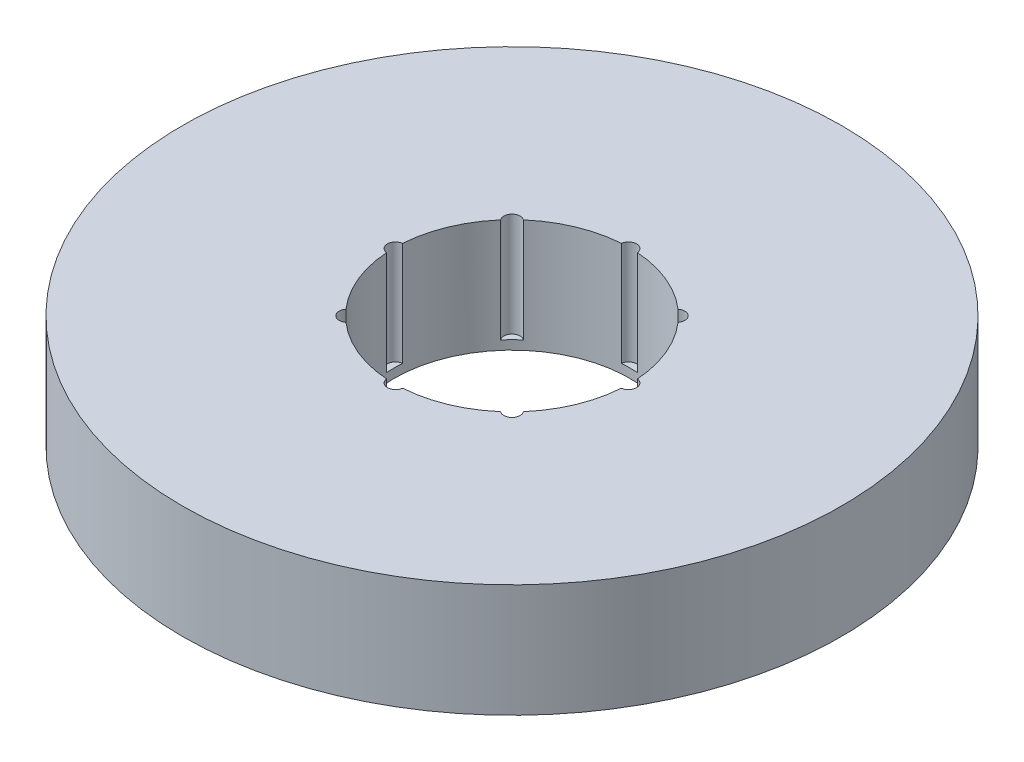
ISO-10303-21;
HEADER;
FILE_DESCRIPTION(('STEP AP214'),'2;1');
FILE_NAME('part.step','',(''),(''),'','','');
FILE_SCHEMA(('AUTOMOTIVE_DESIGN { 1 0 10303 214 1 1 1 1 }'));
ENDSEC;
DATA;
#1=APPLICATION_CONTEXT('core data for automotive mechanical design processes');
#2=APPLICATION_PROTOCOL_DEFINITION('international standard','automotive_design',2000,#1);
#3=PRODUCT_CONTEXT('',#1,'mechanical');
#4=PRODUCT('Part','Part','',(#3));
#5=PRODUCT_RELATED_PRODUCT_CATEGORY('part','',(#4));
#6=PRODUCT_DEFINITION_FORMATION('','',#4);
#7=PRODUCT_DEFINITION_CONTEXT('part definition',#1,'design');
#8=PRODUCT_DEFINITION('design','',#6,#7);
#9=PRODUCT_DEFINITION_SHAPE('','',#8);
#10=(LENGTH_UNIT() NAMED_UNIT(*) SI_UNIT(.MILLI.,.METRE.));
#11=(NAMED_UNIT(*) PLANE_ANGLE_UNIT() SI_UNIT($,.RADIAN.));
#12=(NAMED_UNIT(*) SI_UNIT($,.STERADIAN.) SOLID_ANGLE_UNIT());
#13=UNCERTAINTY_MEASURE_WITH_UNIT(LENGTH_MEASURE(1.E-05),#10,'distance_accuracy_value','');
#14=(GEOMETRIC_REPRESENTATION_CONTEXT(3) GLOBAL_UNCERTAINTY_ASSIGNED_CONTEXT((#13)) GLOBAL_UNIT_ASSIGNED_CONTEXT((#10,
#11,#12)) REPRESENTATION_CONTEXT('',''));
#15=CARTESIAN_POINT('',(0.,0.,0.));
#16=DIRECTION('',(0.,0.,1.));
#17=DIRECTION('',(1.,0.,0.));
#18=AXIS2_PLACEMENT_3D('',#15,#16,#17);
#19=CARTESIAN_POINT('',(0.,24.,0.));
#20=DIRECTION('',(0.,-1.,0.));
#21=DIRECTION('',(0.,0.,-1.));
#22=AXIS2_PLACEMENT_3D('',#19,#20,#21);
#23=CYLINDRICAL_SURFACE('',#22,70.);
#24=CARTESIAN_POINT('',(0.,24.,0.));
#25=DIRECTION('',(0.,1.,0.));
#26=DIRECTION('',(0.,0.,1.));
#27=AXIS2_PLACEMENT_3D('',#24,#25,#26);
#28=CIRCLE('',#27,70.);
#29=CARTESIAN_POINT('',(0.,24.,70.));
#30=VERTEX_POINT('',#29);
#31=EDGE_CURVE('E183',#30,#30,#28,.T.);
#32=ORIENTED_EDGE('',*,*,#31,.F.);
#33=EDGE_LOOP('',(#32));
#34=FACE_BOUND('',#33,.T.);
#35=CARTESIAN_POINT('',(0.,0.,0.));
#36=DIRECTION('',(0.,1.,0.));
#37=DIRECTION('',(0.,0.,1.));
#38=AXIS2_PLACEMENT_3D('',#35,#36,#37);
#39=CIRCLE('',#38,70.);
#40=CARTESIAN_POINT('',(0.,0.,70.));
#41=VERTEX_POINT('',#40);
#42=EDGE_CURVE('E182',#41,#41,#39,.T.);
#43=ORIENTED_EDGE('',*,*,#42,.T.);
#44=EDGE_LOOP('',(#43));
#45=FACE_BOUND('',#44,.T.);
#46=ADVANCED_FACE('F39',(#34,#45),#23,.T.);
#47=CARTESIAN_POINT('',(0.,24.,0.));
#48=DIRECTION('',(0.,1.,0.));
#49=DIRECTION('',(0.,0.,1.));
#50=AXIS2_PLACEMENT_3D('',#47,#48,#49);
#51=PLANE('',#50);
#52=CARTESIAN_POINT('',(0.,24.,24.7356284627399));
#53=DIRECTION('',(0.,1.,0.));
#54=DIRECTION('',(1.,0.,0.));
#55=AXIS2_PLACEMENT_3D('',#52,#53,#54);
#56=CIRCLE('',#55,1.72206010410518);
#57=CARTESIAN_POINT('',(-1.70971361540143,24.,24.9414690696701));
#58=VERTEX_POINT('',#57);
#59=CARTESIAN_POINT('',(1.70971361540161,24.,24.9414690696701));
#60=VERTEX_POINT('',#59);
#61=EDGE_CURVE('E256',#58,#60,#56,.T.);
#62=ORIENTED_EDGE('',*,*,#61,.F.);
#63=CARTESIAN_POINT('',(0.,24.,0.));
#64=DIRECTION('',(0.,1.,0.));
#65=DIRECTION('',(0.,0.,1.));
#66=AXIS2_PLACEMENT_3D('',#63,#64,#65);
#67=CIRCLE('',#66,25.);
#68=CARTESIAN_POINT('',(-16.4273318205809,24.,18.8452320032557));
#69=VERTEX_POINT('',#68);
#70=EDGE_CURVE('E175',#69,#58,#67,.T.);
#71=ORIENTED_EDGE('',*,*,#70,.F.);
#72=CARTESIAN_POINT('',(-17.4907306229143,24.,17.4907306229144));
#73=DIRECTION('',(0.,1.,0.));
#74=DIRECTION('',(0.707106781186549,0.,0.707106781186546));
#75=AXIS2_PLACEMENT_3D('',#72,#73,#74);
#76=CIRCLE('',#75,1.72206010410518);
#77=CARTESIAN_POINT('',(-18.8452320032556,24.,16.4273318205809));
#78=VERTEX_POINT('',#77);
#79=EDGE_CURVE('E152',#78,#69,#76,.T.);
#80=ORIENTED_EDGE('',*,*,#79,.F.);
#81=CARTESIAN_POINT('',(-24.9414690696701,24.,1.70971361540152));
#82=VERTEX_POINT('',#81);
#83=EDGE_CURVE('E168',#82,#78,#67,.T.);
#84=ORIENTED_EDGE('',*,*,#83,.F.);
#85=CARTESIAN_POINT('',(-24.7356284627399,24.,0.));
#86=DIRECTION('',(0.,1.,0.));
#87=DIRECTION('',(0.,0.,1.));
#88=AXIS2_PLACEMENT_3D('',#85,#86,#87);
#89=CIRCLE('',#88,1.72206010410518);
#90=CARTESIAN_POINT('',(-24.9414690696701,24.,-1.70971361540152));
#91=VERTEX_POINT('',#90);
#92=EDGE_CURVE('E205',#91,#82,#89,.T.);
#93=ORIENTED_EDGE('',*,*,#92,.F.);
#94=CARTESIAN_POINT('',(-18.8452320032558,24.,-16.4273318205806));
#95=VERTEX_POINT('',#94);
#96=EDGE_CURVE('E181',#95,#91,#67,.T.);
#97=ORIENTED_EDGE('',*,*,#96,.F.);
#98=CARTESIAN_POINT('',(-17.4907306229145,24.,-17.4907306229141));
#99=DIRECTION('',(0.,1.,0.));
#100=DIRECTION('',(-0.707106781186539,0.,0.707106781186556));
#101=AXIS2_PLACEMENT_3D('',#98,#99,#100);
#102=CIRCLE('',#101,1.72206010410518);
#103=CARTESIAN_POINT('',(-16.4273318205811,24.,-18.8452320032554));
#104=VERTEX_POINT('',#103);
#105=EDGE_CURVE('E453',#104,#95,#102,.T.);
#106=ORIENTED_EDGE('',*,*,#105,.F.);
#107=CARTESIAN_POINT('',(-1.70971361540178,24.,-24.9414690696701));
#108=VERTEX_POINT('',#107);
#109=EDGE_CURVE('E189',#108,#104,#67,.T.);
#110=ORIENTED_EDGE('',*,*,#109,.F.);
#111=CARTESIAN_POINT('',(-2.5909195554664E-13,24.,-24.7356284627399));
#112=DIRECTION('',(0.,1.,0.));
#113=DIRECTION('',(-1.,0.,0.));
#114=AXIS2_PLACEMENT_3D('',#111,#112,#113);
#115=CIRCLE('',#114,1.72206010410518);
#116=CARTESIAN_POINT('',(1.70971361540126,24.,-24.9414690696701));
#117=VERTEX_POINT('',#116);
#118=EDGE_CURVE('E462',#117,#108,#115,.T.);
#119=ORIENTED_EDGE('',*,*,#118,.F.);
#120=CARTESIAN_POINT('',(16.4273318205807,24.,-18.8452320032558));
#121=VERTEX_POINT('',#120);
#122=EDGE_CURVE('E197',#121,#117,#67,.T.);
#123=ORIENTED_EDGE('',*,*,#122,.F.);
#124=CARTESIAN_POINT('',(17.4907306229142,24.,-17.4907306229145));
#125=DIRECTION('',(0.,1.,0.));
#126=DIRECTION('',(-0.707106781186554,0.,-0.707106781186541));
#127=AXIS2_PLACEMENT_3D('',#124,#125,#126);
#128=CIRCLE('',#127,1.72206010410518);
#129=CARTESIAN_POINT('',(18.8452320032555,24.,-16.427331820581));
#130=VERTEX_POINT('',#129);
#131=EDGE_CURVE('E470',#130,#121,#128,.T.);
#132=ORIENTED_EDGE('',*,*,#131,.F.);
#133=CARTESIAN_POINT('',(24.9414690696701,24.,-1.70971361540152));
#134=VERTEX_POINT('',#133);
#135=EDGE_CURVE('E489',#134,#130,#67,.T.);
#136=ORIENTED_EDGE('',*,*,#135,.F.);
#137=CARTESIAN_POINT('',(24.7356284627399,24.,0.));
#138=DIRECTION('',(0.,1.,0.));
#139=DIRECTION('',(0.,0.,-1.));
#140=AXIS2_PLACEMENT_3D('',#137,#138,#139);
#141=CIRCLE('',#140,1.72206010410518);
#142=CARTESIAN_POINT('',(24.9414690696701,24.,1.70971361540152));
#143=VERTEX_POINT('',#142);
#144=EDGE_CURVE('E476',#143,#134,#141,.T.);
#145=ORIENTED_EDGE('',*,*,#144,.F.);
#146=CARTESIAN_POINT('',(18.8452320032557,24.,16.4273318205808));
#147=VERTEX_POINT('',#146);
#148=EDGE_CURVE('E491',#147,#143,#67,.T.);
#149=ORIENTED_EDGE('',*,*,#148,.F.);
#150=CARTESIAN_POINT('',(17.4907306229144,24.,17.4907306229142));
#151=DIRECTION('',(0.,1.,0.));
#152=DIRECTION('',(0.707106781186544,0.,-0.707106781186551));
#153=AXIS2_PLACEMENT_3D('',#150,#151,#152);
#154=CIRCLE('',#153,1.72206010410518);
#155=CARTESIAN_POINT('',(16.427331820581,24.,18.8452320032556));
#156=VERTEX_POINT('',#155);
#157=EDGE_CURVE('E475',#156,#147,#154,.T.);
#158=ORIENTED_EDGE('',*,*,#157,.F.);
#159=EDGE_CURVE('E190',#60,#156,#67,.T.);
#160=ORIENTED_EDGE('',*,*,#159,.F.);
#161=EDGE_LOOP('',(#62,#71,#80,#84,#93,#97,#106,#110,#119,#123,#132,#136,#145,#149,#158,#160));
#162=FACE_BOUND('',#161,.T.);
#163=ORIENTED_EDGE('',*,*,#31,.T.);
#164=EDGE_LOOP('',(#163));
#165=FACE_BOUND('',#164,.T.);
#166=ADVANCED_FACE('F170',(#162,#165),#51,.T.);
#167=CARTESIAN_POINT('',(0.,0.,0.));
#168=DIRECTION('',(0.,1.,0.));
#169=DIRECTION('',(0.,0.,1.));
#170=AXIS2_PLACEMENT_3D('',#167,#168,#169);
#171=PLANE('',#170);
#172=CARTESIAN_POINT('',(0.,0.,0.));
#173=DIRECTION('',(0.,1.,0.));
#174=DIRECTION('',(0.,0.,1.));
#175=AXIS2_PLACEMENT_3D('',#172,#173,#174);
#176=CIRCLE('',#175,25.);
#177=CARTESIAN_POINT('',(0.,0.,25.));
#178=VERTEX_POINT('',#177);
#179=EDGE_CURVE('E191',#178,#178,#176,.T.);
#180=ORIENTED_EDGE('',*,*,#179,.T.);
#181=EDGE_LOOP('',(#180));
#182=FACE_BOUND('',#181,.T.);
#183=ORIENTED_EDGE('',*,*,#42,.F.);
#184=EDGE_LOOP('',(#183));
#185=FACE_BOUND('',#184,.T.);
#186=ADVANCED_FACE('F277',(#182,#185),#171,.F.);
#187=CARTESIAN_POINT('',(0.,24.,0.));
#188=DIRECTION('',(0.,-1.,0.));
#189=DIRECTION('',(0.,0.,-1.));
#190=AXIS2_PLACEMENT_3D('',#187,#188,#189);
#191=CYLINDRICAL_SURFACE('',#190,25.);
#192=DIRECTION('',(0.,1.,0.));
#193=VECTOR('',#192,1.);
#194=CARTESIAN_POINT('',(-1.70971361540143,12.9616445948946,24.9414690696701));
#195=LINE('',#194,#193);
#196=CARTESIAN_POINT('',(-1.70971361540143,1.92328918978923,24.9414690696701));
#197=VERTEX_POINT('',#196);
#198=EDGE_CURVE('E11',#197,#58,#195,.T.);
#199=ORIENTED_EDGE('',*,*,#198,.F.);
#200=CARTESIAN_POINT('',(0.,1.92328918978923,0.));
#201=DIRECTION('',(0.,1.,0.));
#202=DIRECTION('',(0.,0.,1.));
#203=AXIS2_PLACEMENT_3D('',#200,#201,#202);
#204=CIRCLE('',#203,25.);
#205=CARTESIAN_POINT('',(1.70971361540161,1.92328918978923,24.9414690696701));
#206=VERTEX_POINT('',#205);
#207=EDGE_CURVE('E251',#197,#206,#204,.T.);
#208=ORIENTED_EDGE('',*,*,#207,.T.);
#209=DIRECTION('',(0.,1.,0.));
#210=VECTOR('',#209,1.);
#211=CARTESIAN_POINT('',(1.70971361540161,12.9616445948946,24.9414690696701));
#212=LINE('',#211,#210);
#213=EDGE_CURVE('E46',#60,#206,#212,.F.);
#214=ORIENTED_EDGE('',*,*,#213,.F.);
#215=ORIENTED_EDGE('',*,*,#159,.T.);
#216=DIRECTION('',(0.,1.,0.));
#217=VECTOR('',#216,1.);
#218=CARTESIAN_POINT('',(16.427331820581,12.9616445948946,18.8452320032556));
#219=LINE('',#218,#217);
#220=CARTESIAN_POINT('',(16.427331820581,1.92328918978923,18.8452320032556));
#221=VERTEX_POINT('',#220);
#222=EDGE_CURVE('E253',#221,#156,#219,.T.);
#223=ORIENTED_EDGE('',*,*,#222,.F.);
#224=CARTESIAN_POINT('',(0.,1.92328918978923,0.));
#225=DIRECTION('',(0.,1.,0.));
#226=DIRECTION('',(0.,0.,1.));
#227=AXIS2_PLACEMENT_3D('',#224,#225,#226);
#228=CIRCLE('',#227,25.);
#229=CARTESIAN_POINT('',(18.8452320032557,1.92328918978923,16.4273318205808));
#230=VERTEX_POINT('',#229);
#231=EDGE_CURVE('E246',#221,#230,#228,.T.);
#232=ORIENTED_EDGE('',*,*,#231,.T.);
#233=DIRECTION('',(0.,1.,0.));
#234=VECTOR('',#233,1.);
#235=CARTESIAN_POINT('',(18.8452320032557,12.9616445948946,16.4273318205808));
#236=LINE('',#235,#234);
#237=EDGE_CURVE('E248',#147,#230,#236,.F.);
#238=ORIENTED_EDGE('',*,*,#237,.F.);
#239=ORIENTED_EDGE('',*,*,#148,.T.);
#240=DIRECTION('',(0.,1.,0.));
#241=VECTOR('',#240,1.);
#242=CARTESIAN_POINT('',(24.9414690696701,12.9616445948946,1.70971361540152));
#243=LINE('',#242,#241);
#244=CARTESIAN_POINT('',(24.9414690696701,1.92328918978923,1.70971361540152));
#245=VERTEX_POINT('',#244);
#246=EDGE_CURVE('E243',#245,#143,#243,.T.);
#247=ORIENTED_EDGE('',*,*,#246,.F.);
#248=CARTESIAN_POINT('',(0.,1.92328918978923,0.));
#249=DIRECTION('',(0.,1.,0.));
#250=DIRECTION('',(0.,0.,1.));
#251=AXIS2_PLACEMENT_3D('',#248,#249,#250);
#252=CIRCLE('',#251,25.);
#253=CARTESIAN_POINT('',(24.9414690696701,1.92328918978923,-1.70971361540152));
#254=VERTEX_POINT('',#253);
#255=EDGE_CURVE('E236',#245,#254,#252,.T.);
#256=ORIENTED_EDGE('',*,*,#255,.T.);
#257=DIRECTION('',(0.,1.,0.));
#258=VECTOR('',#257,1.);
#259=CARTESIAN_POINT('',(24.9414690696701,12.9616445948946,-1.70971361540152));
#260=LINE('',#259,#258);
#261=EDGE_CURVE('E241',#134,#254,#260,.F.);
#262=ORIENTED_EDGE('',*,*,#261,.F.);
#263=ORIENTED_EDGE('',*,*,#135,.T.);
#264=DIRECTION('',(0.,1.,0.));
#265=VECTOR('',#264,1.);
#266=CARTESIAN_POINT('',(18.8452320032555,12.9616445948946,-16.427331820581));
#267=LINE('',#266,#265);
#268=CARTESIAN_POINT('',(18.8452320032555,1.92328918978923,-16.427331820581));
#269=VERTEX_POINT('',#268);
#270=EDGE_CURVE('E237',#269,#130,#267,.T.);
#271=ORIENTED_EDGE('',*,*,#270,.F.);
#272=CARTESIAN_POINT('',(0.,1.92328918978923,0.));
#273=DIRECTION('',(0.,1.,0.));
#274=DIRECTION('',(0.,0.,1.));
#275=AXIS2_PLACEMENT_3D('',#272,#273,#274);
#276=CIRCLE('',#275,25.);
#277=CARTESIAN_POINT('',(16.4273318205807,1.92328918978923,-18.8452320032558));
#278=VERTEX_POINT('',#277);
#279=EDGE_CURVE('E229',#269,#278,#276,.T.);
#280=ORIENTED_EDGE('',*,*,#279,.T.);
#281=DIRECTION('',(0.,1.,0.));
#282=VECTOR('',#281,1.);
#283=CARTESIAN_POINT('',(16.4273318205807,12.9616445948946,-18.8452320032558));
#284=LINE('',#283,#282);
#285=EDGE_CURVE('E232',#121,#278,#284,.F.);
#286=ORIENTED_EDGE('',*,*,#285,.F.);
#287=ORIENTED_EDGE('',*,*,#122,.T.);
#288=DIRECTION('',(0.,1.,0.));
#289=VECTOR('',#288,1.);
#290=CARTESIAN_POINT('',(1.70971361540126,12.9616445948946,-24.9414690696701));
#291=LINE('',#290,#289);
#292=CARTESIAN_POINT('',(1.70971361540126,1.92328918978923,-24.9414690696701));
#293=VERTEX_POINT('',#292);
#294=EDGE_CURVE('E227',#293,#117,#291,.T.);
#295=ORIENTED_EDGE('',*,*,#294,.F.);
#296=CARTESIAN_POINT('',(0.,1.92328918978923,0.));
#297=DIRECTION('',(0.,1.,0.));
#298=DIRECTION('',(0.,0.,1.));
#299=AXIS2_PLACEMENT_3D('',#296,#297,#298);
#300=CIRCLE('',#299,25.);
#301=CARTESIAN_POINT('',(-1.70971361540178,1.92328918978923,-24.9414690696701));
#302=VERTEX_POINT('',#301);
#303=EDGE_CURVE('E225',#293,#302,#300,.T.);
#304=ORIENTED_EDGE('',*,*,#303,.T.);
#305=DIRECTION('',(0.,1.,0.));
#306=VECTOR('',#305,1.);
#307=CARTESIAN_POINT('',(-1.70971361540178,12.9616445948946,-24.9414690696701));
#308=LINE('',#307,#306);
#309=EDGE_CURVE('E223',#108,#302,#308,.F.);
#310=ORIENTED_EDGE('',*,*,#309,.F.);
#311=ORIENTED_EDGE('',*,*,#109,.T.);
#312=DIRECTION('',(0.,1.,0.));
#313=VECTOR('',#312,1.);
#314=CARTESIAN_POINT('',(-16.4273318205811,12.9616445948946,-18.8452320032555));
#315=LINE('',#314,#313);
#316=CARTESIAN_POINT('',(-16.4273318205811,1.92328918978923,-18.8452320032554));
#317=VERTEX_POINT('',#316);
#318=EDGE_CURVE('E219',#317,#104,#315,.T.);
#319=ORIENTED_EDGE('',*,*,#318,.F.);
#320=CARTESIAN_POINT('',(0.,1.92328918978923,0.));
#321=DIRECTION('',(0.,1.,0.));
#322=DIRECTION('',(0.,0.,1.));
#323=AXIS2_PLACEMENT_3D('',#320,#321,#322);
#324=CIRCLE('',#323,25.);
#325=CARTESIAN_POINT('',(-18.8452320032558,1.92328918978923,-16.4273318205806));
#326=VERTEX_POINT('',#325);
#327=EDGE_CURVE('E159',#317,#326,#324,.T.);
#328=ORIENTED_EDGE('',*,*,#327,.T.);
#329=DIRECTION('',(0.,1.,0.));
#330=VECTOR('',#329,1.);
#331=CARTESIAN_POINT('',(-18.8452320032559,12.9616445948946,-16.4273318205807));
#332=LINE('',#331,#330);
#333=EDGE_CURVE('E220',#95,#326,#332,.F.);
#334=ORIENTED_EDGE('',*,*,#333,.F.);
#335=ORIENTED_EDGE('',*,*,#96,.T.);
#336=DIRECTION('',(0.,1.,0.));
#337=VECTOR('',#336,1.);
#338=CARTESIAN_POINT('',(-24.9414690696701,12.9616445948946,-1.70971361540152));
#339=LINE('',#338,#337);
#340=CARTESIAN_POINT('',(-24.9414690696701,1.92328918978923,-1.70971361540152));
#341=VERTEX_POINT('',#340);
#342=EDGE_CURVE('E209',#341,#91,#339,.T.);
#343=ORIENTED_EDGE('',*,*,#342,.F.);
#344=CARTESIAN_POINT('',(0.,1.92328918978923,0.));
#345=DIRECTION('',(0.,1.,0.));
#346=DIRECTION('',(0.,0.,1.));
#347=AXIS2_PLACEMENT_3D('',#344,#345,#346);
#348=CIRCLE('',#347,25.);
#349=CARTESIAN_POINT('',(-24.9414690696701,1.92328918978923,1.70971361540152));
#350=VERTEX_POINT('',#349);
#351=EDGE_CURVE('E206',#341,#350,#348,.T.);
#352=ORIENTED_EDGE('',*,*,#351,.T.);
#353=DIRECTION('',(0.,1.,0.));
#354=VECTOR('',#353,1.);
#355=CARTESIAN_POINT('',(-24.9414690696701,12.9616445948946,1.70971361540152));
#356=LINE('',#355,#354);
#357=EDGE_CURVE('E179',#82,#350,#356,.F.);
#358=ORIENTED_EDGE('',*,*,#357,.F.);
#359=ORIENTED_EDGE('',*,*,#83,.T.);
#360=DIRECTION('',(0.,1.,0.));
#361=VECTOR('',#360,1.);
#362=CARTESIAN_POINT('',(-18.8452320032556,12.9616445948946,16.4273318205809));
#363=LINE('',#362,#361);
#364=CARTESIAN_POINT('',(-18.8452320032556,1.92328918978923,16.4273318205809));
#365=VERTEX_POINT('',#364);
#366=EDGE_CURVE('E147',#365,#78,#363,.T.);
#367=ORIENTED_EDGE('',*,*,#366,.F.);
#368=CARTESIAN_POINT('',(0.,1.92328918978923,0.));
#369=DIRECTION('',(0.,1.,0.));
#370=DIRECTION('',(0.,0.,1.));
#371=AXIS2_PLACEMENT_3D('',#368,#369,#370);
#372=CIRCLE('',#371,25.);
#373=CARTESIAN_POINT('',(-16.4273318205809,1.92328918978923,18.8452320032557));
#374=VERTEX_POINT('',#373);
#375=EDGE_CURVE('E215',#365,#374,#372,.T.);
#376=ORIENTED_EDGE('',*,*,#375,.T.);
#377=DIRECTION('',(0.,1.,0.));
#378=VECTOR('',#377,1.);
#379=CARTESIAN_POINT('',(-16.4273318205809,12.9616445948946,18.8452320032557));
#380=LINE('',#379,#378);
#381=EDGE_CURVE('E161',#69,#374,#380,.F.);
#382=ORIENTED_EDGE('',*,*,#381,.F.);
#383=ORIENTED_EDGE('',*,*,#70,.T.);
#384=EDGE_LOOP('',(#199,#208,#214,#215,#223,#232,#238,#239,#247,#256,#262,#263,#271,#280,#286,
#287,#295,#304,#310,#311,#319,#328,#334,#335,#343,#352,#358,#359,#367,#376,#382,#383));
#385=FACE_BOUND('',#384,.T.);
#386=ORIENTED_EDGE('',*,*,#179,.F.);
#387=EDGE_LOOP('',(#386));
#388=FACE_BOUND('',#387,.T.);
#389=ADVANCED_FACE('F176',(#385,#388),#191,.F.);
#390=CARTESIAN_POINT('',(-24.7356284627399,1.92328918978923,0.));
#391=DIRECTION('',(0.,1.,0.));
#392=DIRECTION('',(0.,0.,1.));
#393=AXIS2_PLACEMENT_3D('',#390,#391,#392);
#394=CYLINDRICAL_SURFACE('',#393,1.72206010410518);
#395=ORIENTED_EDGE('',*,*,#342,.T.);
#396=ORIENTED_EDGE('',*,*,#92,.T.);
#397=ORIENTED_EDGE('',*,*,#357,.T.);
#398=CARTESIAN_POINT('',(-24.7356284627399,1.92328918978923,0.));
#399=DIRECTION('',(0.,1.,0.));
#400=DIRECTION('',(0.,0.,1.));
#401=AXIS2_PLACEMENT_3D('',#398,#399,#400);
#402=CIRCLE('',#401,1.72206010410518);
#403=EDGE_CURVE('E200',#341,#350,#402,.T.);
#404=ORIENTED_EDGE('',*,*,#403,.F.);
#405=EDGE_LOOP('',(#395,#396,#397,#404));
#406=FACE_BOUND('',#405,.T.);
#407=ADVANCED_FACE('F286',(#406),#394,.F.);
#408=CARTESIAN_POINT('',(-24.7356284627399,1.92328918978923,0.));
#409=DIRECTION('',(0.,1.,0.));
#410=DIRECTION('',(0.,0.,1.));
#411=AXIS2_PLACEMENT_3D('',#408,#409,#410);
#412=PLANE('',#411);
#413=ORIENTED_EDGE('',*,*,#403,.T.);
#414=ORIENTED_EDGE('',*,*,#351,.F.);
#415=EDGE_LOOP('',(#413,#414));
#416=FACE_BOUND('',#415,.T.);
#417=ADVANCED_FACE('F289',(#416),#412,.T.);
#418=CARTESIAN_POINT('',(-17.4907306229143,1.92328918978923,17.4907306229144));
#419=DIRECTION('',(0.,1.,0.));
#420=DIRECTION('',(0.,0.,1.));
#421=AXIS2_PLACEMENT_3D('',#418,#419,#420);
#422=CYLINDRICAL_SURFACE('',#421,1.72206010410518);
#423=ORIENTED_EDGE('',*,*,#366,.T.);
#424=ORIENTED_EDGE('',*,*,#79,.T.);
#425=ORIENTED_EDGE('',*,*,#381,.T.);
#426=CARTESIAN_POINT('',(-17.4907306229143,1.92328918978923,17.4907306229144));
#427=DIRECTION('',(0.,1.,0.));
#428=DIRECTION('',(0.707106781186549,0.,0.707106781186546));
#429=AXIS2_PLACEMENT_3D('',#426,#427,#428);
#430=CIRCLE('',#429,1.72206010410518);
#431=EDGE_CURVE('E156',#365,#374,#430,.T.);
#432=ORIENTED_EDGE('',*,*,#431,.F.);
#433=EDGE_LOOP('',(#423,#424,#425,#432));
#434=FACE_BOUND('',#433,.T.);
#435=ADVANCED_FACE('F155',(#434),#422,.F.);
#436=CARTESIAN_POINT('',(-17.4907306229143,1.92328918978923,17.4907306229144));
#437=DIRECTION('',(0.,1.,0.));
#438=DIRECTION('',(0.707106781186549,0.,0.707106781186546));
#439=AXIS2_PLACEMENT_3D('',#436,#437,#438);
#440=PLANE('',#439);
#441=ORIENTED_EDGE('',*,*,#431,.T.);
#442=ORIENTED_EDGE('',*,*,#375,.F.);
#443=EDGE_LOOP('',(#441,#442));
#444=FACE_BOUND('',#443,.T.);
#445=ADVANCED_FACE('F300',(#444),#440,.T.);
#446=CARTESIAN_POINT('',(-17.4907306229145,1.92328918978923,-17.4907306229141));
#447=DIRECTION('',(0.,1.,0.));
#448=DIRECTION('',(0.,0.,1.));
#449=AXIS2_PLACEMENT_3D('',#446,#447,#448);
#450=CYLINDRICAL_SURFACE('',#449,1.72206010410518);
#451=ORIENTED_EDGE('',*,*,#318,.T.);
#452=ORIENTED_EDGE('',*,*,#105,.T.);
#453=ORIENTED_EDGE('',*,*,#333,.T.);
#454=CARTESIAN_POINT('',(-17.4907306229145,1.92328918978923,-17.4907306229141));
#455=DIRECTION('',(0.,1.,0.));
#456=DIRECTION('',(-0.707106781186539,0.,0.707106781186556));
#457=AXIS2_PLACEMENT_3D('',#454,#455,#456);
#458=CIRCLE('',#457,1.72206010410518);
#459=EDGE_CURVE('E454',#317,#326,#458,.T.);
#460=ORIENTED_EDGE('',*,*,#459,.F.);
#461=EDGE_LOOP('',(#451,#452,#453,#460));
#462=FACE_BOUND('',#461,.T.);
#463=ADVANCED_FACE('F299',(#462),#450,.F.);
#464=CARTESIAN_POINT('',(-17.4907306229145,1.92328918978923,-17.4907306229141));
#465=DIRECTION('',(0.,1.,0.));
#466=DIRECTION('',(-0.707106781186539,0.,0.707106781186556));
#467=AXIS2_PLACEMENT_3D('',#464,#465,#466);
#468=PLANE('',#467);
#469=ORIENTED_EDGE('',*,*,#459,.T.);
#470=ORIENTED_EDGE('',*,*,#327,.F.);
#471=EDGE_LOOP('',(#469,#470));
#472=FACE_BOUND('',#471,.T.);
#473=ADVANCED_FACE('F379',(#472),#468,.T.);
#474=CARTESIAN_POINT('',(-2.5909195554664E-13,1.92328918978923,-24.7356284627399));
#475=DIRECTION('',(0.,1.,0.));
#476=DIRECTION('',(0.,0.,1.));
#477=AXIS2_PLACEMENT_3D('',#474,#475,#476);
#478=CYLINDRICAL_SURFACE('',#477,1.72206010410518);
#479=ORIENTED_EDGE('',*,*,#294,.T.);
#480=ORIENTED_EDGE('',*,*,#118,.T.);
#481=ORIENTED_EDGE('',*,*,#309,.T.);
#482=CARTESIAN_POINT('',(-2.5909195554664E-13,1.92328918978923,-24.7356284627399));
#483=DIRECTION('',(0.,1.,0.));
#484=DIRECTION('',(-1.,0.,0.));
#485=AXIS2_PLACEMENT_3D('',#482,#483,#484);
#486=CIRCLE('',#485,1.72206010410518);
#487=EDGE_CURVE('E465',#293,#302,#486,.T.);
#488=ORIENTED_EDGE('',*,*,#487,.F.);
#489=EDGE_LOOP('',(#479,#480,#481,#488));
#490=FACE_BOUND('',#489,.T.);
#491=ADVANCED_FACE('F371',(#490),#478,.F.);
#492=CARTESIAN_POINT('',(-2.5909195554664E-13,1.92328918978923,-24.7356284627399));
#493=DIRECTION('',(0.,1.,0.));
#494=DIRECTION('',(-1.,0.,0.));
#495=AXIS2_PLACEMENT_3D('',#492,#493,#494);
#496=PLANE('',#495);
#497=ORIENTED_EDGE('',*,*,#487,.T.);
#498=ORIENTED_EDGE('',*,*,#303,.F.);
#499=EDGE_LOOP('',(#497,#498));
#500=FACE_BOUND('',#499,.T.);
#501=ADVANCED_FACE('F308',(#500),#496,.T.);
#502=CARTESIAN_POINT('',(17.4907306229142,1.92328918978923,-17.4907306229145));
#503=DIRECTION('',(0.,1.,0.));
#504=DIRECTION('',(0.,0.,1.));
#505=AXIS2_PLACEMENT_3D('',#502,#503,#504);
#506=CYLINDRICAL_SURFACE('',#505,1.72206010410518);
#507=ORIENTED_EDGE('',*,*,#270,.T.);
#508=ORIENTED_EDGE('',*,*,#131,.T.);
#509=ORIENTED_EDGE('',*,*,#285,.T.);
#510=CARTESIAN_POINT('',(17.4907306229142,1.92328918978923,-17.4907306229145));
#511=DIRECTION('',(0.,1.,0.));
#512=DIRECTION('',(-0.707106781186554,0.,-0.707106781186541));
#513=AXIS2_PLACEMENT_3D('',#510,#511,#512);
#514=CIRCLE('',#513,1.72206010410518);
#515=EDGE_CURVE('E477',#269,#278,#514,.T.);
#516=ORIENTED_EDGE('',*,*,#515,.F.);
#517=EDGE_LOOP('',(#507,#508,#509,#516));
#518=FACE_BOUND('',#517,.T.);
#519=ADVANCED_FACE('F305',(#518),#506,.F.);
#520=CARTESIAN_POINT('',(17.4907306229142,1.92328918978923,-17.4907306229145));
#521=DIRECTION('',(0.,1.,0.));
#522=DIRECTION('',(-0.707106781186554,0.,-0.707106781186541));
#523=AXIS2_PLACEMENT_3D('',#520,#521,#522);
#524=PLANE('',#523);
#525=ORIENTED_EDGE('',*,*,#515,.T.);
#526=ORIENTED_EDGE('',*,*,#279,.F.);
#527=EDGE_LOOP('',(#525,#526));
#528=FACE_BOUND('',#527,.T.);
#529=ADVANCED_FACE('F304',(#528),#524,.T.);
#530=CARTESIAN_POINT('',(24.7356284627399,1.92328918978923,0.));
#531=DIRECTION('',(0.,1.,0.));
#532=DIRECTION('',(0.,0.,1.));
#533=AXIS2_PLACEMENT_3D('',#530,#531,#532);
#534=CYLINDRICAL_SURFACE('',#533,1.72206010410518);
#535=ORIENTED_EDGE('',*,*,#246,.T.);
#536=ORIENTED_EDGE('',*,*,#144,.T.);
#537=ORIENTED_EDGE('',*,*,#261,.T.);
#538=CARTESIAN_POINT('',(24.7356284627399,1.92328918978923,0.));
#539=DIRECTION('',(0.,1.,0.));
#540=DIRECTION('',(0.,0.,-1.));
#541=AXIS2_PLACEMENT_3D('',#538,#539,#540);
#542=CIRCLE('',#541,1.72206010410518);
#543=EDGE_CURVE('E478',#245,#254,#542,.T.);
#544=ORIENTED_EDGE('',*,*,#543,.F.);
#545=EDGE_LOOP('',(#535,#536,#537,#544));
#546=FACE_BOUND('',#545,.T.);
#547=ADVANCED_FACE('F309',(#546),#534,.F.);
#548=CARTESIAN_POINT('',(24.7356284627399,1.92328918978923,0.));
#549=DIRECTION('',(0.,1.,0.));
#550=DIRECTION('',(0.,0.,-1.));
#551=AXIS2_PLACEMENT_3D('',#548,#549,#550);
#552=PLANE('',#551);
#553=ORIENTED_EDGE('',*,*,#543,.T.);
#554=ORIENTED_EDGE('',*,*,#255,.F.);
#555=EDGE_LOOP('',(#553,#554));
#556=FACE_BOUND('',#555,.T.);
#557=ADVANCED_FACE('F314',(#556),#552,.T.);
#558=CARTESIAN_POINT('',(17.4907306229144,1.92328918978923,17.4907306229142));
#559=DIRECTION('',(0.,1.,0.));
#560=DIRECTION('',(0.,0.,1.));
#561=AXIS2_PLACEMENT_3D('',#558,#559,#560);
#562=CYLINDRICAL_SURFACE('',#561,1.72206010410518);
#563=ORIENTED_EDGE('',*,*,#222,.T.);
#564=ORIENTED_EDGE('',*,*,#157,.T.);
#565=ORIENTED_EDGE('',*,*,#237,.T.);
#566=CARTESIAN_POINT('',(17.4907306229144,1.92328918978923,17.4907306229142));
#567=DIRECTION('',(0.,1.,0.));
#568=DIRECTION('',(0.707106781186544,0.,-0.707106781186551));
#569=AXIS2_PLACEMENT_3D('',#566,#567,#568);
#570=CIRCLE('',#569,1.72206010410518);
#571=EDGE_CURVE('E56',#221,#230,#570,.T.);
#572=ORIENTED_EDGE('',*,*,#571,.F.);
#573=EDGE_LOOP('',(#563,#564,#565,#572));
#574=FACE_BOUND('',#573,.T.);
#575=ADVANCED_FACE('F318',(#574),#562,.F.);
#576=CARTESIAN_POINT('',(17.4907306229144,1.92328918978923,17.4907306229142));
#577=DIRECTION('',(0.,1.,0.));
#578=DIRECTION('',(0.707106781186544,0.,-0.707106781186551));
#579=AXIS2_PLACEMENT_3D('',#576,#577,#578);
#580=PLANE('',#579);
#581=ORIENTED_EDGE('',*,*,#571,.T.);
#582=ORIENTED_EDGE('',*,*,#231,.F.);
#583=EDGE_LOOP('',(#581,#582));
#584=FACE_BOUND('',#583,.T.);
#585=ADVANCED_FACE('F270',(#584),#580,.T.);
#586=CARTESIAN_POINT('',(0.,1.92328918978923,24.7356284627399));
#587=DIRECTION('',(0.,1.,0.));
#588=DIRECTION('',(0.,0.,1.));
#589=AXIS2_PLACEMENT_3D('',#586,#587,#588);
#590=CYLINDRICAL_SURFACE('',#589,1.72206010410518);
#591=ORIENTED_EDGE('',*,*,#198,.T.);
#592=ORIENTED_EDGE('',*,*,#61,.T.);
#593=ORIENTED_EDGE('',*,*,#213,.T.);
#594=CARTESIAN_POINT('',(0.,1.92328918978923,24.7356284627399));
#595=DIRECTION('',(0.,1.,0.));
#596=DIRECTION('',(1.,0.,0.));
#597=AXIS2_PLACEMENT_3D('',#594,#595,#596);
#598=CIRCLE('',#597,1.72206010410518);
#599=EDGE_CURVE('E55',#197,#206,#598,.T.);
#600=ORIENTED_EDGE('',*,*,#599,.F.);
#601=EDGE_LOOP('',(#591,#592,#593,#600));
#602=FACE_BOUND('',#601,.T.);
#603=ADVANCED_FACE('F260',(#602),#590,.F.);
#604=CARTESIAN_POINT('',(0.,1.92328918978923,24.7356284627399));
#605=DIRECTION('',(0.,1.,0.));
#606=DIRECTION('',(1.,0.,0.));
#607=AXIS2_PLACEMENT_3D('',#604,#605,#606);
#608=PLANE('',#607);
#609=ORIENTED_EDGE('',*,*,#599,.T.);
#610=ORIENTED_EDGE('',*,*,#207,.F.);
#611=EDGE_LOOP('',(#609,#610));
#612=FACE_BOUND('',#611,.T.);
#613=ADVANCED_FACE('F261',(#612),#608,.T.);
#614=CLOSED_SHELL('',(#46,#166,#186,#389,#407,#417,#435,#445,#463,#473,#491,#501,#519,#529,#547,
#557,#575,#585,#603,#613));
#615=MANIFOLD_SOLID_BREP('B2',#614);
#616=ADVANCED_BREP_SHAPE_REPRESENTATION('',(#18,#615),#14);
#617=SHAPE_DEFINITION_REPRESENTATION(#9,#616);
ENDSEC;
END-ISO-10303-21;
